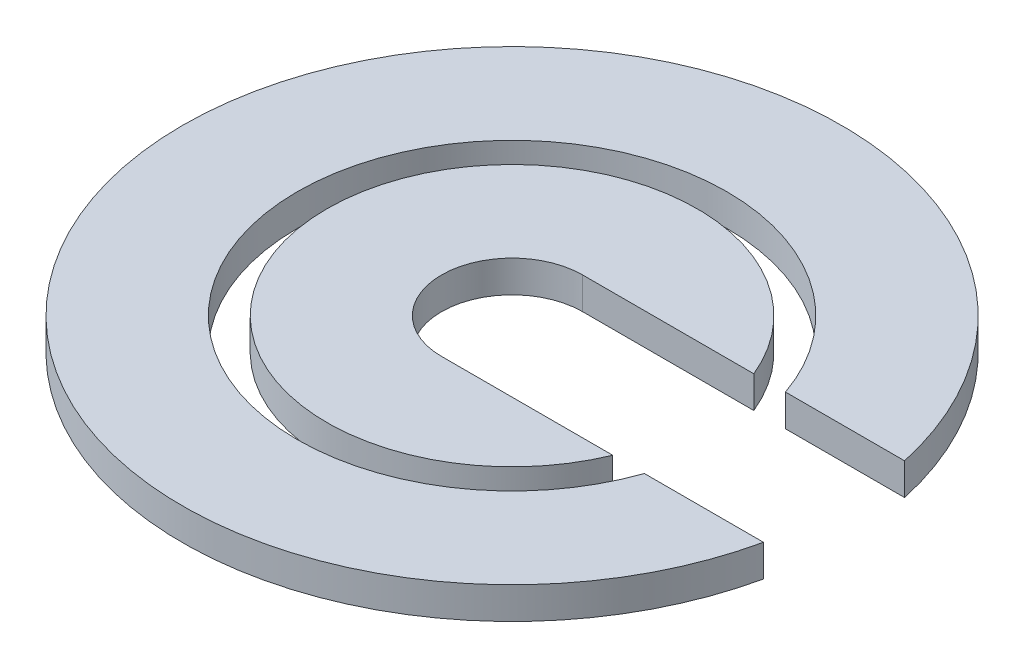
ISO-10303-21;
HEADER;
FILE_DESCRIPTION(('STEP AP214'),'2;1');
FILE_NAME('part.step','',(''),(''),'','','');
FILE_SCHEMA(('AUTOMOTIVE_DESIGN { 1 0 10303 214 1 1 1 1 }'));
ENDSEC;
DATA;
#1=APPLICATION_CONTEXT('core data for automotive mechanical design processes');
#2=APPLICATION_PROTOCOL_DEFINITION('international standard','automotive_design',2000,#1);
#3=PRODUCT_CONTEXT('',#1,'mechanical');
#4=PRODUCT('Part','Part','',(#3));
#5=PRODUCT_RELATED_PRODUCT_CATEGORY('part','',(#4));
#6=PRODUCT_DEFINITION_FORMATION('','',#4);
#7=PRODUCT_DEFINITION_CONTEXT('part definition',#1,'design');
#8=PRODUCT_DEFINITION('design','',#6,#7);
#9=PRODUCT_DEFINITION_SHAPE('','',#8);
#10=(LENGTH_UNIT() NAMED_UNIT(*) SI_UNIT(.MILLI.,.METRE.));
#11=(NAMED_UNIT(*) PLANE_ANGLE_UNIT() SI_UNIT($,.RADIAN.));
#12=(NAMED_UNIT(*) SI_UNIT($,.STERADIAN.) SOLID_ANGLE_UNIT());
#13=UNCERTAINTY_MEASURE_WITH_UNIT(LENGTH_MEASURE(1.E-05),#10,'distance_accuracy_value','');
#14=(GEOMETRIC_REPRESENTATION_CONTEXT(3) GLOBAL_UNCERTAINTY_ASSIGNED_CONTEXT((#13)) GLOBAL_UNIT_ASSIGNED_CONTEXT((#10,
#11,#12)) REPRESENTATION_CONTEXT('',''));
#15=CARTESIAN_POINT('',(0.,0.,0.));
#16=DIRECTION('',(0.,0.,1.));
#17=DIRECTION('',(1.,0.,0.));
#18=AXIS2_PLACEMENT_3D('',#15,#16,#17);
#19=CARTESIAN_POINT('',(82.1734119361419,12.9,-28.575));
#20=DIRECTION('',(0.,0.,-1.));
#21=DIRECTION('',(-1.,0.,0.));
#22=AXIS2_PLACEMENT_3D('',#19,#20,#21);
#23=PLANE('',#22);
#24=DIRECTION('',(1.,0.,0.));
#25=VECTOR('',#24,1.);
#26=CARTESIAN_POINT('',(82.1734119361419,0.,-28.575));
#27=LINE('',#26,#25);
#28=CARTESIAN_POINT('',(82.1734119361419,0.,-28.575));
#29=VERTEX_POINT('',#28);
#30=CARTESIAN_POINT('',(130.406718206331,0.,-28.575));
#31=VERTEX_POINT('',#30);
#32=EDGE_CURVE('E107',#29,#31,#27,.T.);
#33=ORIENTED_EDGE('',*,*,#32,.T.);
#34=DIRECTION('',(0.,-1.,0.));
#35=VECTOR('',#34,1.);
#36=CARTESIAN_POINT('',(130.406718206331,12.9,-28.575));
#37=LINE('',#36,#35);
#38=CARTESIAN_POINT('',(130.406718206331,12.9,-28.575));
#39=VERTEX_POINT('',#38);
#40=EDGE_CURVE('E12',#39,#31,#37,.T.);
#41=ORIENTED_EDGE('',*,*,#40,.F.);
#42=DIRECTION('',(1.,0.,0.));
#43=VECTOR('',#42,1.);
#44=CARTESIAN_POINT('',(82.1734119361419,12.9,-28.575));
#45=LINE('',#44,#43);
#46=CARTESIAN_POINT('',(82.1734119361419,12.9,-28.575));
#47=VERTEX_POINT('',#46);
#48=EDGE_CURVE('E93',#47,#39,#45,.T.);
#49=ORIENTED_EDGE('',*,*,#48,.F.);
#50=DIRECTION('',(0.,-1.,0.));
#51=VECTOR('',#50,1.);
#52=CARTESIAN_POINT('',(82.1734119361419,12.9,-28.575));
#53=LINE('',#52,#51);
#54=EDGE_CURVE('E60',#47,#29,#53,.T.);
#55=ORIENTED_EDGE('',*,*,#54,.T.);
#56=EDGE_LOOP('',(#33,#41,#49,#55));
#57=FACE_BOUND('',#56,.T.);
#58=ADVANCED_FACE('F44',(#57),#23,.F.);
#59=CARTESIAN_POINT('',(0.,12.9,0.));
#60=DIRECTION('',(0.,-1.,0.));
#61=DIRECTION('',(0.,0.,-1.));
#62=AXIS2_PLACEMENT_3D('',#59,#60,#61);
#63=CYLINDRICAL_SURFACE('',#62,133.500722014323);
#64=CARTESIAN_POINT('',(0.,0.,0.));
#65=DIRECTION('',(0.,1.,0.));
#66=DIRECTION('',(0.,0.,1.));
#67=AXIS2_PLACEMENT_3D('',#64,#65,#66);
#68=CIRCLE('',#67,133.500722014323);
#69=CARTESIAN_POINT('',(130.406718206331,0.,28.575));
#70=VERTEX_POINT('',#69);
#71=EDGE_CURVE('E98',#31,#70,#68,.T.);
#72=ORIENTED_EDGE('',*,*,#71,.T.);
#73=DIRECTION('',(0.,-1.,0.));
#74=VECTOR('',#73,1.);
#75=CARTESIAN_POINT('',(130.406718206331,12.9,28.575));
#76=LINE('',#75,#74);
#77=CARTESIAN_POINT('',(130.406718206331,12.9,28.575));
#78=VERTEX_POINT('',#77);
#79=EDGE_CURVE('E52',#78,#70,#76,.T.);
#80=ORIENTED_EDGE('',*,*,#79,.F.);
#81=CARTESIAN_POINT('',(0.,12.9,0.));
#82=DIRECTION('',(0.,1.,0.));
#83=DIRECTION('',(0.,0.,1.));
#84=AXIS2_PLACEMENT_3D('',#81,#82,#83);
#85=CIRCLE('',#84,133.500722014323);
#86=EDGE_CURVE('E85',#39,#78,#85,.T.);
#87=ORIENTED_EDGE('',*,*,#86,.F.);
#88=ORIENTED_EDGE('',*,*,#40,.T.);
#89=EDGE_LOOP('',(#72,#80,#87,#88));
#90=FACE_BOUND('',#89,.T.);
#91=ADVANCED_FACE('F97',(#90),#63,.T.);
#92=CARTESIAN_POINT('',(82.1734119361419,12.9,28.575));
#93=DIRECTION('',(0.,0.,-1.));
#94=DIRECTION('',(-1.,0.,0.));
#95=AXIS2_PLACEMENT_3D('',#92,#93,#94);
#96=PLANE('',#95);
#97=DIRECTION('',(1.,0.,0.));
#98=VECTOR('',#97,1.);
#99=CARTESIAN_POINT('',(82.1734119361419,0.,28.575));
#100=LINE('',#99,#98);
#101=CARTESIAN_POINT('',(82.1734119361419,0.,28.575));
#102=VERTEX_POINT('',#101);
#103=EDGE_CURVE('E110',#102,#70,#100,.T.);
#104=ORIENTED_EDGE('',*,*,#103,.F.);
#105=DIRECTION('',(0.,-1.,0.));
#106=VECTOR('',#105,1.);
#107=CARTESIAN_POINT('',(82.1734119361419,12.9,28.575));
#108=LINE('',#107,#106);
#109=CARTESIAN_POINT('',(82.1734119361419,12.9,28.575));
#110=VERTEX_POINT('',#109);
#111=EDGE_CURVE('E74',#110,#102,#108,.T.);
#112=ORIENTED_EDGE('',*,*,#111,.F.);
#113=DIRECTION('',(1.,0.,0.));
#114=VECTOR('',#113,1.);
#115=CARTESIAN_POINT('',(82.1734119361419,12.9,28.575));
#116=LINE('',#115,#114);
#117=EDGE_CURVE('E92',#110,#78,#116,.T.);
#118=ORIENTED_EDGE('',*,*,#117,.T.);
#119=ORIENTED_EDGE('',*,*,#79,.T.);
#120=EDGE_LOOP('',(#104,#112,#118,#119));
#121=FACE_BOUND('',#120,.T.);
#122=ADVANCED_FACE('F101',(#121),#96,.T.);
#123=CARTESIAN_POINT('',(0.,12.9,0.));
#124=DIRECTION('',(0.,-1.,0.));
#125=DIRECTION('',(0.,0.,-1.));
#126=AXIS2_PLACEMENT_3D('',#123,#124,#125);
#127=CYLINDRICAL_SURFACE('',#126,87.0000014610739);
#128=CARTESIAN_POINT('',(0.,0.,0.));
#129=DIRECTION('',(0.,1.,0.));
#130=DIRECTION('',(0.,0.,1.));
#131=AXIS2_PLACEMENT_3D('',#128,#129,#130);
#132=CIRCLE('',#131,87.0000014610739);
#133=EDGE_CURVE('E112',#29,#102,#132,.T.);
#134=ORIENTED_EDGE('',*,*,#133,.F.);
#135=ORIENTED_EDGE('',*,*,#54,.F.);
#136=CARTESIAN_POINT('',(0.,12.9,0.));
#137=DIRECTION('',(0.,1.,0.));
#138=DIRECTION('',(0.,0.,1.));
#139=AXIS2_PLACEMENT_3D('',#136,#137,#138);
#140=CIRCLE('',#139,87.0000014610739);
#141=EDGE_CURVE('E102',#47,#110,#140,.T.);
#142=ORIENTED_EDGE('',*,*,#141,.T.);
#143=ORIENTED_EDGE('',*,*,#111,.T.);
#144=EDGE_LOOP('',(#134,#135,#142,#143));
#145=FACE_BOUND('',#144,.T.);
#146=ADVANCED_FACE('F118',(#145),#127,.F.);
#147=CARTESIAN_POINT('',(0.,12.9,0.));
#148=DIRECTION('',(0.,1.,0.));
#149=DIRECTION('',(0.,0.,1.));
#150=AXIS2_PLACEMENT_3D('',#147,#148,#149);
#151=PLANE('',#150);
#152=ORIENTED_EDGE('',*,*,#48,.T.);
#153=ORIENTED_EDGE('',*,*,#86,.T.);
#154=ORIENTED_EDGE('',*,*,#117,.F.);
#155=ORIENTED_EDGE('',*,*,#141,.F.);
#156=EDGE_LOOP('',(#152,#153,#154,#155));
#157=FACE_BOUND('',#156,.T.);
#158=ADVANCED_FACE('F89',(#157),#151,.T.);
#159=CARTESIAN_POINT('',(0.,0.,0.));
#160=DIRECTION('',(0.,1.,0.));
#161=DIRECTION('',(0.,0.,1.));
#162=AXIS2_PLACEMENT_3D('',#159,#160,#161);
#163=PLANE('',#162);
#164=ORIENTED_EDGE('',*,*,#32,.F.);
#165=ORIENTED_EDGE('',*,*,#133,.T.);
#166=ORIENTED_EDGE('',*,*,#103,.T.);
#167=ORIENTED_EDGE('',*,*,#71,.F.);
#168=EDGE_LOOP('',(#164,#165,#166,#167));
#169=FACE_BOUND('',#168,.T.);
#170=ADVANCED_FACE('F117',(#169),#163,.F.);
#171=CLOSED_SHELL('',(#58,#91,#122,#146,#158,#170));
#172=MANIFOLD_SOLID_BREP('B2',#171);
#173=CARTESIAN_POINT('',(0.,12.9,-28.575));
#174=DIRECTION('',(0.,0.,-1.));
#175=DIRECTION('',(-1.,0.,0.));
#176=AXIS2_PLACEMENT_3D('',#173,#174,#175);
#177=PLANE('',#176);
#178=DIRECTION('',(1.,0.,0.));
#179=VECTOR('',#178,1.);
#180=CARTESIAN_POINT('',(0.,0.,-28.575));
#181=LINE('',#180,#179);
#182=CARTESIAN_POINT('',(0.,0.,-28.575));
#183=VERTEX_POINT('',#182);
#184=CARTESIAN_POINT('',(69.3431278137928,0.,-28.575));
#185=VERTEX_POINT('',#184);
#186=EDGE_CURVE('E230',#183,#185,#181,.T.);
#187=ORIENTED_EDGE('',*,*,#186,.T.);
#188=DIRECTION('',(0.,-1.,0.));
#189=VECTOR('',#188,1.);
#190=CARTESIAN_POINT('',(69.3431278137928,12.9,-28.575));
#191=LINE('',#190,#189);
#192=CARTESIAN_POINT('',(69.3431278137928,12.9,-28.575));
#193=VERTEX_POINT('',#192);
#194=EDGE_CURVE('E42',#193,#185,#191,.T.);
#195=ORIENTED_EDGE('',*,*,#194,.F.);
#196=DIRECTION('',(1.,0.,0.));
#197=VECTOR('',#196,1.);
#198=CARTESIAN_POINT('',(0.,12.9,-28.575));
#199=LINE('',#198,#197);
#200=CARTESIAN_POINT('',(0.,12.9,-28.575));
#201=VERTEX_POINT('',#200);
#202=EDGE_CURVE('E216',#201,#193,#199,.T.);
#203=ORIENTED_EDGE('',*,*,#202,.F.);
#204=DIRECTION('',(0.,-1.,0.));
#205=VECTOR('',#204,1.);
#206=CARTESIAN_POINT('',(0.,12.9,-28.575));
#207=LINE('',#206,#205);
#208=EDGE_CURVE('E183',#201,#183,#207,.T.);
#209=ORIENTED_EDGE('',*,*,#208,.T.);
#210=EDGE_LOOP('',(#187,#195,#203,#209));
#211=FACE_BOUND('',#210,.T.);
#212=ADVANCED_FACE('F167',(#211),#177,.F.);
#213=CARTESIAN_POINT('',(0.,12.9,0.));
#214=DIRECTION('',(0.,-1.,0.));
#215=DIRECTION('',(0.,0.,-1.));
#216=AXIS2_PLACEMENT_3D('',#213,#214,#215);
#217=CYLINDRICAL_SURFACE('',#216,75.);
#218=CARTESIAN_POINT('',(0.,0.,0.));
#219=DIRECTION('',(0.,1.,0.));
#220=DIRECTION('',(0.,0.,1.));
#221=AXIS2_PLACEMENT_3D('',#218,#219,#220);
#222=CIRCLE('',#221,75.);
#223=CARTESIAN_POINT('',(69.3431278137928,0.,28.575));
#224=VERTEX_POINT('',#223);
#225=EDGE_CURVE('E221',#185,#224,#222,.T.);
#226=ORIENTED_EDGE('',*,*,#225,.T.);
#227=DIRECTION('',(0.,-1.,0.));
#228=VECTOR('',#227,1.);
#229=CARTESIAN_POINT('',(69.3431278137928,12.9,28.575));
#230=LINE('',#229,#228);
#231=CARTESIAN_POINT('',(69.3431278137928,12.9,28.575));
#232=VERTEX_POINT('',#231);
#233=EDGE_CURVE('E175',#232,#224,#230,.T.);
#234=ORIENTED_EDGE('',*,*,#233,.F.);
#235=CARTESIAN_POINT('',(0.,12.9,0.));
#236=DIRECTION('',(0.,1.,0.));
#237=DIRECTION('',(0.,0.,1.));
#238=AXIS2_PLACEMENT_3D('',#235,#236,#237);
#239=CIRCLE('',#238,75.);
#240=EDGE_CURVE('E208',#193,#232,#239,.T.);
#241=ORIENTED_EDGE('',*,*,#240,.F.);
#242=ORIENTED_EDGE('',*,*,#194,.T.);
#243=EDGE_LOOP('',(#226,#234,#241,#242));
#244=FACE_BOUND('',#243,.T.);
#245=ADVANCED_FACE('F220',(#244),#217,.T.);
#246=CARTESIAN_POINT('',(0.,12.9,28.575));
#247=DIRECTION('',(0.,0.,-1.));
#248=DIRECTION('',(-1.,0.,0.));
#249=AXIS2_PLACEMENT_3D('',#246,#247,#248);
#250=PLANE('',#249);
#251=DIRECTION('',(1.,0.,0.));
#252=VECTOR('',#251,1.);
#253=CARTESIAN_POINT('',(0.,0.,28.575));
#254=LINE('',#253,#252);
#255=CARTESIAN_POINT('',(0.,0.,28.575));
#256=VERTEX_POINT('',#255);
#257=EDGE_CURVE('E233',#256,#224,#254,.T.);
#258=ORIENTED_EDGE('',*,*,#257,.F.);
#259=DIRECTION('',(0.,-1.,0.));
#260=VECTOR('',#259,1.);
#261=CARTESIAN_POINT('',(0.,12.9,28.575));
#262=LINE('',#261,#260);
#263=CARTESIAN_POINT('',(0.,12.9,28.575));
#264=VERTEX_POINT('',#263);
#265=EDGE_CURVE('E197',#264,#256,#262,.T.);
#266=ORIENTED_EDGE('',*,*,#265,.F.);
#267=DIRECTION('',(1.,0.,0.));
#268=VECTOR('',#267,1.);
#269=CARTESIAN_POINT('',(0.,12.9,28.575));
#270=LINE('',#269,#268);
#271=EDGE_CURVE('E215',#264,#232,#270,.T.);
#272=ORIENTED_EDGE('',*,*,#271,.T.);
#273=ORIENTED_EDGE('',*,*,#233,.T.);
#274=EDGE_LOOP('',(#258,#266,#272,#273));
#275=FACE_BOUND('',#274,.T.);
#276=ADVANCED_FACE('F224',(#275),#250,.T.);
#277=CARTESIAN_POINT('',(0.,12.9,0.));
#278=DIRECTION('',(0.,-1.,0.));
#279=DIRECTION('',(0.,0.,-1.));
#280=AXIS2_PLACEMENT_3D('',#277,#278,#279);
#281=CYLINDRICAL_SURFACE('',#280,28.575);
#282=CARTESIAN_POINT('',(0.,0.,0.));
#283=DIRECTION('',(0.,1.,0.));
#284=DIRECTION('',(0.,0.,1.));
#285=AXIS2_PLACEMENT_3D('',#282,#283,#284);
#286=CIRCLE('',#285,28.575);
#287=EDGE_CURVE('E235',#183,#256,#286,.T.);
#288=ORIENTED_EDGE('',*,*,#287,.F.);
#289=ORIENTED_EDGE('',*,*,#208,.F.);
#290=CARTESIAN_POINT('',(0.,12.9,0.));
#291=DIRECTION('',(0.,1.,0.));
#292=DIRECTION('',(0.,0.,1.));
#293=AXIS2_PLACEMENT_3D('',#290,#291,#292);
#294=CIRCLE('',#293,28.575);
#295=EDGE_CURVE('E225',#201,#264,#294,.T.);
#296=ORIENTED_EDGE('',*,*,#295,.T.);
#297=ORIENTED_EDGE('',*,*,#265,.T.);
#298=EDGE_LOOP('',(#288,#289,#296,#297));
#299=FACE_BOUND('',#298,.T.);
#300=ADVANCED_FACE('F241',(#299),#281,.F.);
#301=CARTESIAN_POINT('',(0.,12.9,0.));
#302=DIRECTION('',(0.,1.,0.));
#303=DIRECTION('',(0.,0.,1.));
#304=AXIS2_PLACEMENT_3D('',#301,#302,#303);
#305=PLANE('',#304);
#306=ORIENTED_EDGE('',*,*,#202,.T.);
#307=ORIENTED_EDGE('',*,*,#240,.T.);
#308=ORIENTED_EDGE('',*,*,#271,.F.);
#309=ORIENTED_EDGE('',*,*,#295,.F.);
#310=EDGE_LOOP('',(#306,#307,#308,#309));
#311=FACE_BOUND('',#310,.T.);
#312=ADVANCED_FACE('F212',(#311),#305,.T.);
#313=CARTESIAN_POINT('',(0.,0.,0.));
#314=DIRECTION('',(0.,1.,0.));
#315=DIRECTION('',(0.,0.,1.));
#316=AXIS2_PLACEMENT_3D('',#313,#314,#315);
#317=PLANE('',#316);
#318=ORIENTED_EDGE('',*,*,#186,.F.);
#319=ORIENTED_EDGE('',*,*,#287,.T.);
#320=ORIENTED_EDGE('',*,*,#257,.T.);
#321=ORIENTED_EDGE('',*,*,#225,.F.);
#322=EDGE_LOOP('',(#318,#319,#320,#321));
#323=FACE_BOUND('',#322,.T.);
#324=ADVANCED_FACE('F240',(#323),#317,.F.);
#325=CLOSED_SHELL('',(#212,#245,#276,#300,#312,#324));
#326=MANIFOLD_SOLID_BREP('B6',#325);
#327=ADVANCED_BREP_SHAPE_REPRESENTATION('',(#18,#172,#326),#14);
#328=SHAPE_DEFINITION_REPRESENTATION(#9,#327);
ENDSEC;
END-ISO-10303-21;
